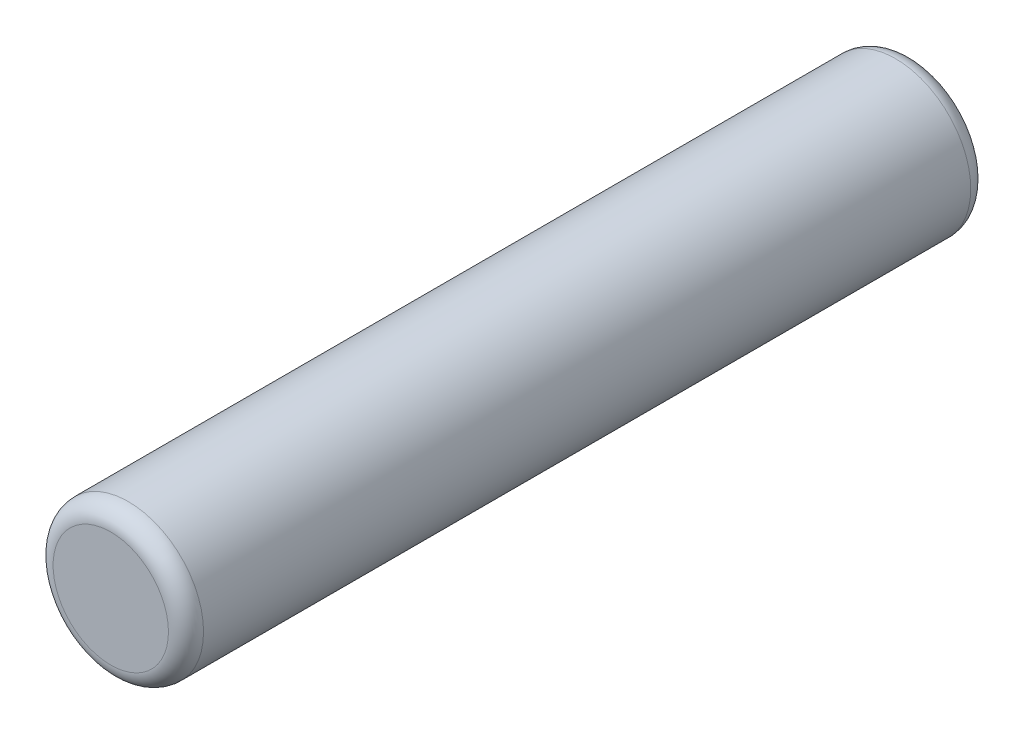
ISO-10303-21;
HEADER;
FILE_DESCRIPTION(('STEP AP214'),'2;1');
FILE_NAME('part.step','',(''),(''),'','','');
FILE_SCHEMA(('AUTOMOTIVE_DESIGN { 1 0 10303 214 1 1 1 1 }'));
ENDSEC;
DATA;
#1=APPLICATION_CONTEXT('core data for automotive mechanical design processes');
#2=APPLICATION_PROTOCOL_DEFINITION('international standard','automotive_design',2000,#1);
#3=PRODUCT_CONTEXT('',#1,'mechanical');
#4=PRODUCT('Part','Part','',(#3));
#5=PRODUCT_RELATED_PRODUCT_CATEGORY('part','',(#4));
#6=PRODUCT_DEFINITION_FORMATION('','',#4);
#7=PRODUCT_DEFINITION_CONTEXT('part definition',#1,'design');
#8=PRODUCT_DEFINITION('design','',#6,#7);
#9=PRODUCT_DEFINITION_SHAPE('','',#8);
#10=(LENGTH_UNIT() NAMED_UNIT(*) SI_UNIT(.MILLI.,.METRE.));
#11=(NAMED_UNIT(*) PLANE_ANGLE_UNIT() SI_UNIT($,.RADIAN.));
#12=(NAMED_UNIT(*) SI_UNIT($,.STERADIAN.) SOLID_ANGLE_UNIT());
#13=UNCERTAINTY_MEASURE_WITH_UNIT(LENGTH_MEASURE(1.E-05),#10,'distance_accuracy_value','');
#14=(GEOMETRIC_REPRESENTATION_CONTEXT(3) GLOBAL_UNCERTAINTY_ASSIGNED_CONTEXT((#13)) GLOBAL_UNIT_ASSIGNED_CONTEXT((#10,
#11,#12)) REPRESENTATION_CONTEXT('',''));
#15=CARTESIAN_POINT('',(0.,0.,0.));
#16=DIRECTION('',(0.,0.,1.));
#17=DIRECTION('',(1.,0.,0.));
#18=AXIS2_PLACEMENT_3D('',#15,#16,#17);
#19=CARTESIAN_POINT('',(0.,0.,8.));
#20=DIRECTION('',(0.,0.,-1.));
#21=DIRECTION('',(-1.,0.,0.));
#22=AXIS2_PLACEMENT_3D('',#19,#20,#21);
#23=CYLINDRICAL_SURFACE('',#22,1.5);
#24=CARTESIAN_POINT('',(0.,0.,-7.65));
#25=DIRECTION('',(0.,0.,1.));
#26=DIRECTION('',(1.,0.,0.));
#27=AXIS2_PLACEMENT_3D('',#24,#25,#26);
#28=CIRCLE('',#27,1.5);
#29=CARTESIAN_POINT('',(1.5,0.,-7.65));
#30=VERTEX_POINT('',#29);
#31=EDGE_CURVE('E42',#30,#30,#28,.T.);
#32=ORIENTED_EDGE('',*,*,#31,.T.);
#33=EDGE_LOOP('',(#32));
#34=FACE_BOUND('',#33,.T.);
#35=CARTESIAN_POINT('',(0.,0.,7.65));
#36=DIRECTION('',(0.,0.,1.));
#37=DIRECTION('',(1.,0.,0.));
#38=AXIS2_PLACEMENT_3D('',#35,#36,#37);
#39=CIRCLE('',#38,1.5);
#40=CARTESIAN_POINT('',(1.5,0.,7.65));
#41=VERTEX_POINT('',#40);
#42=EDGE_CURVE('E46',#41,#41,#39,.F.);
#43=ORIENTED_EDGE('',*,*,#42,.T.);
#44=EDGE_LOOP('',(#43));
#45=FACE_BOUND('',#44,.T.);
#46=ADVANCED_FACE('F31',(#34,#45),#23,.T.);
#47=CARTESIAN_POINT('',(0.,0.,8.));
#48=DIRECTION('',(0.,0.,1.));
#49=DIRECTION('',(1.,0.,0.));
#50=AXIS2_PLACEMENT_3D('',#47,#48,#49);
#51=PLANE('',#50);
#52=CARTESIAN_POINT('',(0.,0.,8.));
#53=DIRECTION('',(0.,0.,1.));
#54=DIRECTION('',(1.,0.,0.));
#55=AXIS2_PLACEMENT_3D('',#52,#53,#54);
#56=CIRCLE('',#55,1.15);
#57=CARTESIAN_POINT('',(1.15,0.,8.));
#58=VERTEX_POINT('',#57);
#59=EDGE_CURVE('E10',#58,#58,#56,.T.);
#60=ORIENTED_EDGE('',*,*,#59,.T.);
#61=EDGE_LOOP('',(#60));
#62=FACE_BOUND('',#61,.T.);
#63=ADVANCED_FACE('F62',(#62),#51,.T.);
#64=CARTESIAN_POINT('',(0.,0.,-8.));
#65=DIRECTION('',(0.,0.,1.));
#66=DIRECTION('',(1.,0.,0.));
#67=AXIS2_PLACEMENT_3D('',#64,#65,#66);
#68=PLANE('',#67);
#69=CARTESIAN_POINT('',(0.,0.,-8.));
#70=DIRECTION('',(0.,0.,1.));
#71=DIRECTION('',(1.,0.,0.));
#72=AXIS2_PLACEMENT_3D('',#69,#70,#71);
#73=CIRCLE('',#72,1.15);
#74=CARTESIAN_POINT('',(1.15,0.,-8.));
#75=VERTEX_POINT('',#74);
#76=EDGE_CURVE('E38',#75,#75,#73,.F.);
#77=ORIENTED_EDGE('',*,*,#76,.T.);
#78=EDGE_LOOP('',(#77));
#79=FACE_BOUND('',#78,.T.);
#80=ADVANCED_FACE('F59',(#79),#68,.F.);
#81=CARTESIAN_POINT('',(0.,0.,-7.65));
#82=DIRECTION('',(0.,0.,1.));
#83=DIRECTION('',(1.,0.,0.));
#84=AXIS2_PLACEMENT_3D('',#81,#82,#83);
#85=TOROIDAL_SURFACE('',#84,1.15,0.35);
#86=ORIENTED_EDGE('',*,*,#76,.F.);
#87=EDGE_LOOP('',(#86));
#88=FACE_BOUND('',#87,.T.);
#89=ORIENTED_EDGE('',*,*,#31,.F.);
#90=EDGE_LOOP('',(#89));
#91=FACE_BOUND('',#90,.T.);
#92=ADVANCED_FACE('F55',(#88,#91),#85,.T.);
#93=CARTESIAN_POINT('',(0.,0.,7.65));
#94=DIRECTION('',(0.,0.,1.));
#95=DIRECTION('',(1.,0.,0.));
#96=AXIS2_PLACEMENT_3D('',#93,#94,#95);
#97=TOROIDAL_SURFACE('',#96,1.15,0.35);
#98=ORIENTED_EDGE('',*,*,#42,.F.);
#99=EDGE_LOOP('',(#98));
#100=FACE_BOUND('',#99,.T.);
#101=ORIENTED_EDGE('',*,*,#59,.F.);
#102=EDGE_LOOP('',(#101));
#103=FACE_BOUND('',#102,.T.);
#104=ADVANCED_FACE('F33',(#100,#103),#97,.T.);
#105=CLOSED_SHELL('',(#46,#63,#80,#92,#104));
#106=MANIFOLD_SOLID_BREP('B2',#105);
#107=ADVANCED_BREP_SHAPE_REPRESENTATION('',(#18,#106),#14);
#108=SHAPE_DEFINITION_REPRESENTATION(#9,#107);
ENDSEC;
END-ISO-10303-21;
